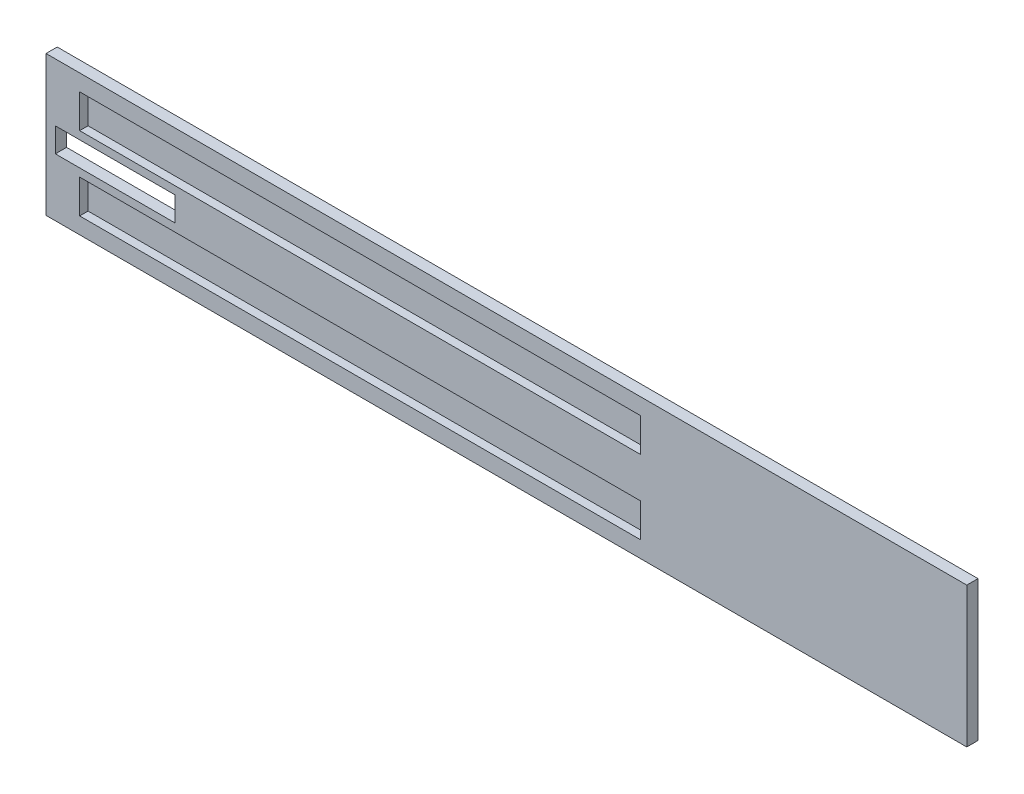
ISO-10303-21;
HEADER;
FILE_DESCRIPTION(('STEP AP214'),'2;1');
FILE_NAME('part.step','',(''),(''),'','','');
FILE_SCHEMA(('AUTOMOTIVE_DESIGN { 1 0 10303 214 1 1 1 1 }'));
ENDSEC;
DATA;
#1=APPLICATION_CONTEXT('core data for automotive mechanical design processes');
#2=APPLICATION_PROTOCOL_DEFINITION('international standard','automotive_design',2000,#1);
#3=PRODUCT_CONTEXT('',#1,'mechanical');
#4=PRODUCT('Part','Part','',(#3));
#5=PRODUCT_RELATED_PRODUCT_CATEGORY('part','',(#4));
#6=PRODUCT_DEFINITION_FORMATION('','',#4);
#7=PRODUCT_DEFINITION_CONTEXT('part definition',#1,'design');
#8=PRODUCT_DEFINITION('design','',#6,#7);
#9=PRODUCT_DEFINITION_SHAPE('','',#8);
#10=(LENGTH_UNIT() NAMED_UNIT(*) SI_UNIT(.MILLI.,.METRE.));
#11=(NAMED_UNIT(*) PLANE_ANGLE_UNIT() SI_UNIT($,.RADIAN.));
#12=(NAMED_UNIT(*) SI_UNIT($,.STERADIAN.) SOLID_ANGLE_UNIT());
#13=UNCERTAINTY_MEASURE_WITH_UNIT(LENGTH_MEASURE(1.E-05),#10,'distance_accuracy_value','');
#14=(GEOMETRIC_REPRESENTATION_CONTEXT(3) GLOBAL_UNCERTAINTY_ASSIGNED_CONTEXT((#13)) GLOBAL_UNIT_ASSIGNED_CONTEXT((#10,
#11,#12)) REPRESENTATION_CONTEXT('',''));
#15=CARTESIAN_POINT('',(0.,0.,0.));
#16=DIRECTION('',(0.,0.,1.));
#17=DIRECTION('',(1.,0.,0.));
#18=AXIS2_PLACEMENT_3D('',#15,#16,#17);
#19=CARTESIAN_POINT('',(985.,0.,12.));
#20=DIRECTION('',(0.,1.,0.));
#21=DIRECTION('',(-1.,0.,0.));
#22=AXIS2_PLACEMENT_3D('',#19,#20,#21);
#23=PLANE('',#22);
#24=DIRECTION('',(1.,0.,0.));
#25=VECTOR('',#24,1.);
#26=CARTESIAN_POINT('',(985.,0.,0.));
#27=LINE('',#26,#25);
#28=CARTESIAN_POINT('',(0.,0.,0.));
#29=VERTEX_POINT('',#28);
#30=CARTESIAN_POINT('',(985.,0.,0.));
#31=VERTEX_POINT('',#30);
#32=EDGE_CURVE('E239',#29,#31,#27,.T.);
#33=ORIENTED_EDGE('',*,*,#32,.T.);
#34=DIRECTION('',(0.,0.,-1.));
#35=VECTOR('',#34,1.);
#36=CARTESIAN_POINT('',(985.,0.,12.));
#37=LINE('',#36,#35);
#38=CARTESIAN_POINT('',(985.,0.,12.));
#39=VERTEX_POINT('',#38);
#40=EDGE_CURVE('E11',#39,#31,#37,.T.);
#41=ORIENTED_EDGE('',*,*,#40,.F.);
#42=DIRECTION('',(1.,0.,0.));
#43=VECTOR('',#42,1.);
#44=CARTESIAN_POINT('',(985.,0.,12.));
#45=LINE('',#44,#43);
#46=CARTESIAN_POINT('',(0.,0.,12.));
#47=VERTEX_POINT('',#46);
#48=EDGE_CURVE('E291',#47,#39,#45,.T.);
#49=ORIENTED_EDGE('',*,*,#48,.F.);
#50=DIRECTION('',(0.,0.,-1.));
#51=VECTOR('',#50,1.);
#52=CARTESIAN_POINT('',(0.,0.,12.));
#53=LINE('',#52,#51);
#54=EDGE_CURVE('E305',#47,#29,#53,.T.);
#55=ORIENTED_EDGE('',*,*,#54,.T.);
#56=EDGE_LOOP('',(#33,#41,#49,#55));
#57=FACE_BOUND('',#56,.T.);
#58=ADVANCED_FACE('F41',(#57),#23,.F.);
#59=CARTESIAN_POINT('',(985.,150.,12.));
#60=DIRECTION('',(-1.,0.,0.));
#61=DIRECTION('',(0.,-1.,0.));
#62=AXIS2_PLACEMENT_3D('',#59,#60,#61);
#63=PLANE('',#62);
#64=DIRECTION('',(0.,1.,0.));
#65=VECTOR('',#64,1.);
#66=CARTESIAN_POINT('',(985.,150.,0.));
#67=LINE('',#66,#65);
#68=CARTESIAN_POINT('',(985.,150.,0.));
#69=VERTEX_POINT('',#68);
#70=EDGE_CURVE('E309',#31,#69,#67,.T.);
#71=ORIENTED_EDGE('',*,*,#70,.T.);
#72=DIRECTION('',(0.,0.,-1.));
#73=VECTOR('',#72,1.);
#74=CARTESIAN_POINT('',(985.,150.,12.));
#75=LINE('',#74,#73);
#76=CARTESIAN_POINT('',(985.,150.,12.));
#77=VERTEX_POINT('',#76);
#78=EDGE_CURVE('E49',#77,#69,#75,.T.);
#79=ORIENTED_EDGE('',*,*,#78,.F.);
#80=DIRECTION('',(0.,1.,0.));
#81=VECTOR('',#80,1.);
#82=CARTESIAN_POINT('',(985.,150.,12.));
#83=LINE('',#82,#81);
#84=EDGE_CURVE('E295',#39,#77,#83,.T.);
#85=ORIENTED_EDGE('',*,*,#84,.F.);
#86=ORIENTED_EDGE('',*,*,#40,.T.);
#87=EDGE_LOOP('',(#71,#79,#85,#86));
#88=FACE_BOUND('',#87,.T.);
#89=ADVANCED_FACE('F343',(#88),#63,.F.);
#90=CARTESIAN_POINT('',(0.,150.,12.));
#91=DIRECTION('',(0.,-1.,0.));
#92=DIRECTION('',(1.,0.,0.));
#93=AXIS2_PLACEMENT_3D('',#90,#91,#92);
#94=PLANE('',#93);
#95=DIRECTION('',(-1.,0.,0.));
#96=VECTOR('',#95,1.);
#97=CARTESIAN_POINT('',(0.,150.,0.));
#98=LINE('',#97,#96);
#99=CARTESIAN_POINT('',(0.,150.,0.));
#100=VERTEX_POINT('',#99);
#101=EDGE_CURVE('E312',#69,#100,#98,.T.);
#102=ORIENTED_EDGE('',*,*,#101,.T.);
#103=DIRECTION('',(0.,0.,-1.));
#104=VECTOR('',#103,1.);
#105=CARTESIAN_POINT('',(0.,150.,12.));
#106=LINE('',#105,#104);
#107=CARTESIAN_POINT('',(0.,150.,12.));
#108=VERTEX_POINT('',#107);
#109=EDGE_CURVE('E320',#108,#100,#106,.T.);
#110=ORIENTED_EDGE('',*,*,#109,.F.);
#111=DIRECTION('',(-1.,0.,0.));
#112=VECTOR('',#111,1.);
#113=CARTESIAN_POINT('',(0.,150.,12.));
#114=LINE('',#113,#112);
#115=EDGE_CURVE('E299',#77,#108,#114,.T.);
#116=ORIENTED_EDGE('',*,*,#115,.F.);
#117=ORIENTED_EDGE('',*,*,#78,.T.);
#118=EDGE_LOOP('',(#102,#110,#116,#117));
#119=FACE_BOUND('',#118,.T.);
#120=ADVANCED_FACE('F329',(#119),#94,.F.);
#121=CARTESIAN_POINT('',(0.,0.,12.));
#122=DIRECTION('',(1.,0.,0.));
#123=DIRECTION('',(0.,1.,0.));
#124=AXIS2_PLACEMENT_3D('',#121,#122,#123);
#125=PLANE('',#124);
#126=DIRECTION('',(0.,-1.,0.));
#127=VECTOR('',#126,1.);
#128=CARTESIAN_POINT('',(0.,0.,0.));
#129=LINE('',#128,#127);
#130=EDGE_CURVE('E296',#100,#29,#129,.T.);
#131=ORIENTED_EDGE('',*,*,#130,.T.);
#132=ORIENTED_EDGE('',*,*,#54,.F.);
#133=DIRECTION('',(0.,-1.,0.));
#134=VECTOR('',#133,1.);
#135=CARTESIAN_POINT('',(0.,0.,12.));
#136=LINE('',#135,#134);
#137=EDGE_CURVE('E302',#108,#47,#136,.T.);
#138=ORIENTED_EDGE('',*,*,#137,.F.);
#139=ORIENTED_EDGE('',*,*,#109,.T.);
#140=EDGE_LOOP('',(#131,#132,#138,#139));
#141=FACE_BOUND('',#140,.T.);
#142=ADVANCED_FACE('F336',(#141),#125,.F.);
#143=CARTESIAN_POINT('',(0.,0.,12.));
#144=DIRECTION('',(0.,0.,-1.));
#145=DIRECTION('',(-1.,0.,0.));
#146=AXIS2_PLACEMENT_3D('',#143,#144,#145);
#147=PLANE('',#146);
#148=DIRECTION('',(0.,-1.,0.));
#149=VECTOR('',#148,1.);
#150=CARTESIAN_POINT('',(9.99999999999995,61.9999999999999,12.));
#151=LINE('',#150,#149);
#152=CARTESIAN_POINT('',(9.99999999999994,87.9999999999999,12.));
#153=VERTEX_POINT('',#152);
#154=CARTESIAN_POINT('',(9.99999999999995,61.9999999999999,12.));
#155=VERTEX_POINT('',#154);
#156=EDGE_CURVE('E188',#153,#155,#151,.T.);
#157=ORIENTED_EDGE('',*,*,#156,.F.);
#158=DIRECTION('',(-1.,0.,0.));
#159=VECTOR('',#158,1.);
#160=CARTESIAN_POINT('',(9.99999999999994,87.9999999999999,12.));
#161=LINE('',#160,#159);
#162=CARTESIAN_POINT('',(138.261008081655,87.9999999999999,12.));
#163=VERTEX_POINT('',#162);
#164=EDGE_CURVE('E56',#163,#153,#161,.T.);
#165=ORIENTED_EDGE('',*,*,#164,.F.);
#166=DIRECTION('',(0.,1.,0.));
#167=VECTOR('',#166,1.);
#168=CARTESIAN_POINT('',(138.261008081655,87.9999999999999,12.));
#169=LINE('',#168,#167);
#170=CARTESIAN_POINT('',(138.261008081655,62.,12.));
#171=VERTEX_POINT('',#170);
#172=EDGE_CURVE('E175',#171,#163,#169,.T.);
#173=ORIENTED_EDGE('',*,*,#172,.F.);
#174=DIRECTION('',(1.,0.,0.));
#175=VECTOR('',#174,1.);
#176=CARTESIAN_POINT('',(138.261008081655,62.,12.));
#177=LINE('',#176,#175);
#178=EDGE_CURVE('E179',#155,#171,#177,.T.);
#179=ORIENTED_EDGE('',*,*,#178,.F.);
#180=EDGE_LOOP('',(#157,#165,#173,#179));
#181=FACE_BOUND('',#180,.T.);
#182=DIRECTION('',(1.,0.,0.));
#183=VECTOR('',#182,1.);
#184=CARTESIAN_POINT('',(36.,96.5,12.));
#185=LINE('',#184,#183);
#186=CARTESIAN_POINT('',(36.,96.5,12.));
#187=VERTEX_POINT('',#186);
#188=CARTESIAN_POINT('',(636.,96.5,12.));
#189=VERTEX_POINT('',#188);
#190=EDGE_CURVE('E224',#187,#189,#185,.T.);
#191=ORIENTED_EDGE('',*,*,#190,.F.);
#192=DIRECTION('',(0.,-1.,0.));
#193=VECTOR('',#192,1.);
#194=CARTESIAN_POINT('',(36.,132.5,12.));
#195=LINE('',#194,#193);
#196=CARTESIAN_POINT('',(36.,132.5,12.));
#197=VERTEX_POINT('',#196);
#198=EDGE_CURVE('E221',#197,#187,#195,.T.);
#199=ORIENTED_EDGE('',*,*,#198,.F.);
#200=DIRECTION('',(-1.,0.,0.));
#201=VECTOR('',#200,1.);
#202=CARTESIAN_POINT('',(636.,132.5,12.));
#203=LINE('',#202,#201);
#204=CARTESIAN_POINT('',(636.,132.5,12.));
#205=VERTEX_POINT('',#204);
#206=EDGE_CURVE('E208',#205,#197,#203,.T.);
#207=ORIENTED_EDGE('',*,*,#206,.F.);
#208=DIRECTION('',(0.,1.,0.));
#209=VECTOR('',#208,1.);
#210=CARTESIAN_POINT('',(636.,96.5,12.));
#211=LINE('',#210,#209);
#212=EDGE_CURVE('E229',#189,#205,#211,.T.);
#213=ORIENTED_EDGE('',*,*,#212,.F.);
#214=EDGE_LOOP('',(#191,#199,#207,#213));
#215=FACE_BOUND('',#214,.T.);
#216=DIRECTION('',(0.,1.,0.));
#217=VECTOR('',#216,1.);
#218=CARTESIAN_POINT('',(636.,53.5,12.));
#219=LINE('',#218,#217);
#220=CARTESIAN_POINT('',(636.,17.5,12.));
#221=VERTEX_POINT('',#220);
#222=CARTESIAN_POINT('',(636.,53.5,12.));
#223=VERTEX_POINT('',#222);
#224=EDGE_CURVE('E269',#221,#223,#219,.T.);
#225=ORIENTED_EDGE('',*,*,#224,.F.);
#226=DIRECTION('',(1.,0.,0.));
#227=VECTOR('',#226,1.);
#228=CARTESIAN_POINT('',(636.,17.5,12.));
#229=LINE('',#228,#227);
#230=CARTESIAN_POINT('',(36.,17.5,12.));
#231=VERTEX_POINT('',#230);
#232=EDGE_CURVE('E197',#231,#221,#229,.T.);
#233=ORIENTED_EDGE('',*,*,#232,.F.);
#234=DIRECTION('',(0.,-1.,0.));
#235=VECTOR('',#234,1.);
#236=CARTESIAN_POINT('',(36.,17.5,12.));
#237=LINE('',#236,#235);
#238=CARTESIAN_POINT('',(36.,53.5,12.));
#239=VERTEX_POINT('',#238);
#240=EDGE_CURVE('E254',#239,#231,#237,.T.);
#241=ORIENTED_EDGE('',*,*,#240,.F.);
#242=DIRECTION('',(-1.,0.,0.));
#243=VECTOR('',#242,1.);
#244=CARTESIAN_POINT('',(36.,53.5,12.));
#245=LINE('',#244,#243);
#246=EDGE_CURVE('E273',#223,#239,#245,.T.);
#247=ORIENTED_EDGE('',*,*,#246,.F.);
#248=EDGE_LOOP('',(#225,#233,#241,#247));
#249=FACE_BOUND('',#248,.T.);
#250=ORIENTED_EDGE('',*,*,#48,.T.);
#251=ORIENTED_EDGE('',*,*,#84,.T.);
#252=ORIENTED_EDGE('',*,*,#115,.T.);
#253=ORIENTED_EDGE('',*,*,#137,.T.);
#254=EDGE_LOOP('',(#250,#251,#252,#253));
#255=FACE_BOUND('',#254,.T.);
#256=ADVANCED_FACE('F342',(#181,#215,#249,#255),#147,.F.);
#257=CARTESIAN_POINT('',(0.,0.,0.));
#258=DIRECTION('',(0.,0.,-1.));
#259=DIRECTION('',(-1.,0.,0.));
#260=AXIS2_PLACEMENT_3D('',#257,#258,#259);
#261=PLANE('',#260);
#262=DIRECTION('',(-1.,0.,0.));
#263=VECTOR('',#262,1.);
#264=CARTESIAN_POINT('',(9.99999999999994,87.9999999999999,0.));
#265=LINE('',#264,#263);
#266=CARTESIAN_POINT('',(138.261008081655,87.9999999999999,0.));
#267=VERTEX_POINT('',#266);
#268=CARTESIAN_POINT('',(9.99999999999994,87.9999999999999,0.));
#269=VERTEX_POINT('',#268);
#270=EDGE_CURVE('E156',#267,#269,#265,.T.);
#271=ORIENTED_EDGE('',*,*,#270,.T.);
#272=DIRECTION('',(0.,-1.,0.));
#273=VECTOR('',#272,1.);
#274=CARTESIAN_POINT('',(9.99999999999995,61.9999999999999,0.));
#275=LINE('',#274,#273);
#276=CARTESIAN_POINT('',(9.99999999999995,61.9999999999999,0.));
#277=VERTEX_POINT('',#276);
#278=EDGE_CURVE('E166',#269,#277,#275,.T.);
#279=ORIENTED_EDGE('',*,*,#278,.T.);
#280=DIRECTION('',(1.,0.,0.));
#281=VECTOR('',#280,1.);
#282=CARTESIAN_POINT('',(138.261008081655,62.,0.));
#283=LINE('',#282,#281);
#284=CARTESIAN_POINT('',(138.261008081655,62.,0.));
#285=VERTEX_POINT('',#284);
#286=EDGE_CURVE('E64',#277,#285,#283,.T.);
#287=ORIENTED_EDGE('',*,*,#286,.T.);
#288=DIRECTION('',(0.,1.,0.));
#289=VECTOR('',#288,1.);
#290=CARTESIAN_POINT('',(138.261008081655,87.9999999999999,0.));
#291=LINE('',#290,#289);
#292=EDGE_CURVE('E163',#285,#267,#291,.T.);
#293=ORIENTED_EDGE('',*,*,#292,.T.);
#294=EDGE_LOOP('',(#271,#279,#287,#293));
#295=FACE_BOUND('',#294,.T.);
#296=ORIENTED_EDGE('',*,*,#32,.F.);
#297=ORIENTED_EDGE('',*,*,#130,.F.);
#298=ORIENTED_EDGE('',*,*,#101,.F.);
#299=ORIENTED_EDGE('',*,*,#70,.F.);
#300=EDGE_LOOP('',(#296,#297,#298,#299));
#301=FACE_BOUND('',#300,.T.);
#302=ADVANCED_FACE('F171',(#295,#301),#261,.T.);
#303=CARTESIAN_POINT('',(636.,17.5,3.));
#304=DIRECTION('',(0.,-1.,0.));
#305=DIRECTION('',(0.,0.,-1.));
#306=AXIS2_PLACEMENT_3D('',#303,#304,#305);
#307=PLANE('',#306);
#308=ORIENTED_EDGE('',*,*,#232,.T.);
#309=DIRECTION('',(0.,0.,1.));
#310=VECTOR('',#309,1.);
#311=CARTESIAN_POINT('',(636.,17.5,3.));
#312=LINE('',#311,#310);
#313=CARTESIAN_POINT('',(636.,17.5,3.));
#314=VERTEX_POINT('',#313);
#315=EDGE_CURVE('E266',#314,#221,#312,.T.);
#316=ORIENTED_EDGE('',*,*,#315,.F.);
#317=DIRECTION('',(1.,0.,0.));
#318=VECTOR('',#317,1.);
#319=CARTESIAN_POINT('',(636.,17.5,3.));
#320=LINE('',#319,#318);
#321=CARTESIAN_POINT('',(36.,17.5,3.));
#322=VERTEX_POINT('',#321);
#323=EDGE_CURVE('E249',#322,#314,#320,.T.);
#324=ORIENTED_EDGE('',*,*,#323,.F.);
#325=DIRECTION('',(0.,0.,1.));
#326=VECTOR('',#325,1.);
#327=CARTESIAN_POINT('',(36.,17.5,3.));
#328=LINE('',#327,#326);
#329=EDGE_CURVE('E225',#322,#231,#328,.T.);
#330=ORIENTED_EDGE('',*,*,#329,.T.);
#331=EDGE_LOOP('',(#308,#316,#324,#330));
#332=FACE_BOUND('',#331,.T.);
#333=ADVANCED_FACE('F355',(#332),#307,.F.);
#334=CARTESIAN_POINT('',(36.,17.5,3.));
#335=DIRECTION('',(-1.,0.,0.));
#336=DIRECTION('',(0.,-1.,0.));
#337=AXIS2_PLACEMENT_3D('',#334,#335,#336);
#338=PLANE('',#337);
#339=ORIENTED_EDGE('',*,*,#240,.T.);
#340=ORIENTED_EDGE('',*,*,#329,.F.);
#341=DIRECTION('',(0.,-1.,0.));
#342=VECTOR('',#341,1.);
#343=CARTESIAN_POINT('',(36.,17.5,3.));
#344=LINE('',#343,#342);
#345=CARTESIAN_POINT('',(36.,53.5,3.));
#346=VERTEX_POINT('',#345);
#347=EDGE_CURVE('E262',#346,#322,#344,.T.);
#348=ORIENTED_EDGE('',*,*,#347,.F.);
#349=DIRECTION('',(0.,0.,1.));
#350=VECTOR('',#349,1.);
#351=CARTESIAN_POINT('',(36.,53.5,3.));
#352=LINE('',#351,#350);
#353=EDGE_CURVE('E282',#346,#239,#352,.T.);
#354=ORIENTED_EDGE('',*,*,#353,.T.);
#355=EDGE_LOOP('',(#339,#340,#348,#354));
#356=FACE_BOUND('',#355,.T.);
#357=ADVANCED_FACE('F361',(#356),#338,.F.);
#358=CARTESIAN_POINT('',(36.,53.5,3.));
#359=DIRECTION('',(0.,1.,0.));
#360=DIRECTION('',(0.,0.,1.));
#361=AXIS2_PLACEMENT_3D('',#358,#359,#360);
#362=PLANE('',#361);
#363=ORIENTED_EDGE('',*,*,#246,.T.);
#364=ORIENTED_EDGE('',*,*,#353,.F.);
#365=DIRECTION('',(-1.,0.,0.));
#366=VECTOR('',#365,1.);
#367=CARTESIAN_POINT('',(36.,53.5,3.));
#368=LINE('',#367,#366);
#369=CARTESIAN_POINT('',(636.,53.5,3.));
#370=VERTEX_POINT('',#369);
#371=EDGE_CURVE('E258',#370,#346,#368,.T.);
#372=ORIENTED_EDGE('',*,*,#371,.F.);
#373=DIRECTION('',(0.,0.,1.));
#374=VECTOR('',#373,1.);
#375=CARTESIAN_POINT('',(636.,53.5,3.));
#376=LINE('',#375,#374);
#377=EDGE_CURVE('E285',#370,#223,#376,.T.);
#378=ORIENTED_EDGE('',*,*,#377,.T.);
#379=EDGE_LOOP('',(#363,#364,#372,#378));
#380=FACE_BOUND('',#379,.T.);
#381=ADVANCED_FACE('F367',(#380),#362,.F.);
#382=CARTESIAN_POINT('',(636.,53.5,3.));
#383=DIRECTION('',(1.,0.,0.));
#384=DIRECTION('',(0.,0.,-1.));
#385=AXIS2_PLACEMENT_3D('',#382,#383,#384);
#386=PLANE('',#385);
#387=ORIENTED_EDGE('',*,*,#224,.T.);
#388=ORIENTED_EDGE('',*,*,#377,.F.);
#389=DIRECTION('',(0.,1.,0.));
#390=VECTOR('',#389,1.);
#391=CARTESIAN_POINT('',(636.,53.5,3.));
#392=LINE('',#391,#390);
#393=EDGE_CURVE('E253',#314,#370,#392,.T.);
#394=ORIENTED_EDGE('',*,*,#393,.F.);
#395=ORIENTED_EDGE('',*,*,#315,.T.);
#396=EDGE_LOOP('',(#387,#388,#394,#395));
#397=FACE_BOUND('',#396,.T.);
#398=ADVANCED_FACE('F363',(#397),#386,.F.);
#399=CARTESIAN_POINT('',(0.,0.,3.));
#400=DIRECTION('',(0.,0.,-1.));
#401=DIRECTION('',(-1.,0.,0.));
#402=AXIS2_PLACEMENT_3D('',#399,#400,#401);
#403=PLANE('',#402);
#404=ORIENTED_EDGE('',*,*,#323,.T.);
#405=ORIENTED_EDGE('',*,*,#393,.T.);
#406=ORIENTED_EDGE('',*,*,#371,.T.);
#407=ORIENTED_EDGE('',*,*,#347,.T.);
#408=EDGE_LOOP('',(#404,#405,#406,#407));
#409=FACE_BOUND('',#408,.T.);
#410=ADVANCED_FACE('F366',(#409),#403,.F.);
#411=CARTESIAN_POINT('',(36.,132.5,3.));
#412=DIRECTION('',(-1.,0.,0.));
#413=DIRECTION('',(0.,0.,1.));
#414=AXIS2_PLACEMENT_3D('',#411,#412,#413);
#415=PLANE('',#414);
#416=ORIENTED_EDGE('',*,*,#198,.T.);
#417=DIRECTION('',(0.,0.,1.));
#418=VECTOR('',#417,1.);
#419=CARTESIAN_POINT('',(36.,96.5,3.));
#420=LINE('',#419,#418);
#421=CARTESIAN_POINT('',(36.,96.5,3.));
#422=VERTEX_POINT('',#421);
#423=EDGE_CURVE('E220',#422,#187,#420,.T.);
#424=ORIENTED_EDGE('',*,*,#423,.F.);
#425=DIRECTION('',(0.,-1.,0.));
#426=VECTOR('',#425,1.);
#427=CARTESIAN_POINT('',(36.,132.5,3.));
#428=LINE('',#427,#426);
#429=CARTESIAN_POINT('',(36.,132.5,3.));
#430=VERTEX_POINT('',#429);
#431=EDGE_CURVE('E203',#430,#422,#428,.T.);
#432=ORIENTED_EDGE('',*,*,#431,.F.);
#433=DIRECTION('',(0.,0.,1.));
#434=VECTOR('',#433,1.);
#435=CARTESIAN_POINT('',(36.,132.5,3.));
#436=LINE('',#435,#434);
#437=EDGE_CURVE('E236',#430,#197,#436,.T.);
#438=ORIENTED_EDGE('',*,*,#437,.T.);
#439=EDGE_LOOP('',(#416,#424,#432,#438));
#440=FACE_BOUND('',#439,.T.);
#441=ADVANCED_FACE('F377',(#440),#415,.F.);
#442=CARTESIAN_POINT('',(636.,132.5,3.));
#443=DIRECTION('',(0.,1.,0.));
#444=DIRECTION('',(-1.,0.,0.));
#445=AXIS2_PLACEMENT_3D('',#442,#443,#444);
#446=PLANE('',#445);
#447=ORIENTED_EDGE('',*,*,#206,.T.);
#448=ORIENTED_EDGE('',*,*,#437,.F.);
#449=DIRECTION('',(-1.,0.,0.));
#450=VECTOR('',#449,1.);
#451=CARTESIAN_POINT('',(636.,132.5,3.));
#452=LINE('',#451,#450);
#453=CARTESIAN_POINT('',(636.,132.5,3.));
#454=VERTEX_POINT('',#453);
#455=EDGE_CURVE('E216',#454,#430,#452,.T.);
#456=ORIENTED_EDGE('',*,*,#455,.F.);
#457=DIRECTION('',(0.,0.,1.));
#458=VECTOR('',#457,1.);
#459=CARTESIAN_POINT('',(636.,132.5,3.));
#460=LINE('',#459,#458);
#461=EDGE_CURVE('E240',#454,#205,#460,.T.);
#462=ORIENTED_EDGE('',*,*,#461,.T.);
#463=EDGE_LOOP('',(#447,#448,#456,#462));
#464=FACE_BOUND('',#463,.T.);
#465=ADVANCED_FACE('F381',(#464),#446,.F.);
#466=CARTESIAN_POINT('',(636.,96.5,3.));
#467=DIRECTION('',(1.,0.,0.));
#468=DIRECTION('',(0.,0.,-1.));
#469=AXIS2_PLACEMENT_3D('',#466,#467,#468);
#470=PLANE('',#469);
#471=ORIENTED_EDGE('',*,*,#212,.T.);
#472=ORIENTED_EDGE('',*,*,#461,.F.);
#473=DIRECTION('',(0.,1.,0.));
#474=VECTOR('',#473,1.);
#475=CARTESIAN_POINT('',(636.,96.5,3.));
#476=LINE('',#475,#474);
#477=CARTESIAN_POINT('',(636.,96.5,3.));
#478=VERTEX_POINT('',#477);
#479=EDGE_CURVE('E212',#478,#454,#476,.T.);
#480=ORIENTED_EDGE('',*,*,#479,.F.);
#481=DIRECTION('',(0.,0.,1.));
#482=VECTOR('',#481,1.);
#483=CARTESIAN_POINT('',(636.,96.5,3.));
#484=LINE('',#483,#482);
#485=EDGE_CURVE('E243',#478,#189,#484,.T.);
#486=ORIENTED_EDGE('',*,*,#485,.T.);
#487=EDGE_LOOP('',(#471,#472,#480,#486));
#488=FACE_BOUND('',#487,.T.);
#489=ADVANCED_FACE('F387',(#488),#470,.F.);
#490=CARTESIAN_POINT('',(36.,96.5,3.));
#491=DIRECTION('',(0.,-1.,0.));
#492=DIRECTION('',(0.,0.,-1.));
#493=AXIS2_PLACEMENT_3D('',#490,#491,#492);
#494=PLANE('',#493);
#495=ORIENTED_EDGE('',*,*,#190,.T.);
#496=ORIENTED_EDGE('',*,*,#485,.F.);
#497=DIRECTION('',(1.,0.,0.));
#498=VECTOR('',#497,1.);
#499=CARTESIAN_POINT('',(36.,96.5,3.));
#500=LINE('',#499,#498);
#501=EDGE_CURVE('E207',#422,#478,#500,.T.);
#502=ORIENTED_EDGE('',*,*,#501,.F.);
#503=ORIENTED_EDGE('',*,*,#423,.T.);
#504=EDGE_LOOP('',(#495,#496,#502,#503));
#505=FACE_BOUND('',#504,.T.);
#506=ADVANCED_FACE('F383',(#505),#494,.F.);
#507=CARTESIAN_POINT('',(0.,0.,3.));
#508=DIRECTION('',(0.,0.,1.));
#509=DIRECTION('',(1.,0.,0.));
#510=AXIS2_PLACEMENT_3D('',#507,#508,#509);
#511=PLANE('',#510);
#512=ORIENTED_EDGE('',*,*,#431,.T.);
#513=ORIENTED_EDGE('',*,*,#501,.T.);
#514=ORIENTED_EDGE('',*,*,#479,.T.);
#515=ORIENTED_EDGE('',*,*,#455,.T.);
#516=EDGE_LOOP('',(#512,#513,#514,#515));
#517=FACE_BOUND('',#516,.T.);
#518=ADVANCED_FACE('F386',(#517),#511,.T.);
#519=CARTESIAN_POINT('',(9.99999999999994,87.9999999999999,0.));
#520=DIRECTION('',(0.,1.,0.));
#521=DIRECTION('',(0.,0.,1.));
#522=AXIS2_PLACEMENT_3D('',#519,#520,#521);
#523=PLANE('',#522);
#524=ORIENTED_EDGE('',*,*,#164,.T.);
#525=DIRECTION('',(0.,0.,1.));
#526=VECTOR('',#525,1.);
#527=CARTESIAN_POINT('',(9.99999999999994,87.9999999999999,0.));
#528=LINE('',#527,#526);
#529=EDGE_CURVE('E152',#269,#153,#528,.T.);
#530=ORIENTED_EDGE('',*,*,#529,.F.);
#531=ORIENTED_EDGE('',*,*,#270,.F.);
#532=DIRECTION('',(0.,0.,1.));
#533=VECTOR('',#532,1.);
#534=CARTESIAN_POINT('',(138.261008081655,87.9999999999999,0.));
#535=LINE('',#534,#533);
#536=EDGE_CURVE('E194',#267,#163,#535,.T.);
#537=ORIENTED_EDGE('',*,*,#536,.T.);
#538=EDGE_LOOP('',(#524,#530,#531,#537));
#539=FACE_BOUND('',#538,.T.);
#540=ADVANCED_FACE('F154',(#539),#523,.F.);
#541=CARTESIAN_POINT('',(138.261008081655,87.9999999999999,0.));
#542=DIRECTION('',(1.,0.,0.));
#543=DIRECTION('',(0.,0.,-1.));
#544=AXIS2_PLACEMENT_3D('',#541,#542,#543);
#545=PLANE('',#544);
#546=ORIENTED_EDGE('',*,*,#172,.T.);
#547=ORIENTED_EDGE('',*,*,#536,.F.);
#548=ORIENTED_EDGE('',*,*,#292,.F.);
#549=DIRECTION('',(0.,0.,1.));
#550=VECTOR('',#549,1.);
#551=CARTESIAN_POINT('',(138.261008081655,62.,0.));
#552=LINE('',#551,#550);
#553=EDGE_CURVE('E198',#285,#171,#552,.T.);
#554=ORIENTED_EDGE('',*,*,#553,.T.);
#555=EDGE_LOOP('',(#546,#547,#548,#554));
#556=FACE_BOUND('',#555,.T.);
#557=ADVANCED_FACE('F400',(#556),#545,.F.);
#558=CARTESIAN_POINT('',(138.261008081655,62.,0.));
#559=DIRECTION('',(0.,-1.,0.));
#560=DIRECTION('',(1.,0.,0.));
#561=AXIS2_PLACEMENT_3D('',#558,#559,#560);
#562=PLANE('',#561);
#563=ORIENTED_EDGE('',*,*,#178,.T.);
#564=ORIENTED_EDGE('',*,*,#553,.F.);
#565=ORIENTED_EDGE('',*,*,#286,.F.);
#566=DIRECTION('',(0.,0.,1.));
#567=VECTOR('',#566,1.);
#568=CARTESIAN_POINT('',(9.99999999999995,61.9999999999999,0.));
#569=LINE('',#568,#567);
#570=EDGE_CURVE('E162',#277,#155,#569,.T.);
#571=ORIENTED_EDGE('',*,*,#570,.T.);
#572=EDGE_LOOP('',(#563,#564,#565,#571));
#573=FACE_BOUND('',#572,.T.);
#574=ADVANCED_FACE('F403',(#573),#562,.F.);
#575=CARTESIAN_POINT('',(9.99999999999995,61.9999999999999,0.));
#576=DIRECTION('',(-1.,0.,0.));
#577=DIRECTION('',(0.,-1.,0.));
#578=AXIS2_PLACEMENT_3D('',#575,#576,#577);
#579=PLANE('',#578);
#580=ORIENTED_EDGE('',*,*,#156,.T.);
#581=ORIENTED_EDGE('',*,*,#570,.F.);
#582=ORIENTED_EDGE('',*,*,#278,.F.);
#583=ORIENTED_EDGE('',*,*,#529,.T.);
#584=EDGE_LOOP('',(#580,#581,#582,#583));
#585=FACE_BOUND('',#584,.T.);
#586=ADVANCED_FACE('F167',(#585),#579,.F.);
#587=CLOSED_SHELL('',(#58,#89,#120,#142,#256,#302,#333,#357,#381,#398,#410,#441,#465,#489,#506,
#518,#540,#557,#574,#586));
#588=MANIFOLD_SOLID_BREP('B2',#587);
#589=ADVANCED_BREP_SHAPE_REPRESENTATION('',(#18,#588),#14);
#590=SHAPE_DEFINITION_REPRESENTATION(#9,#589);
ENDSEC;
END-ISO-10303-21;
